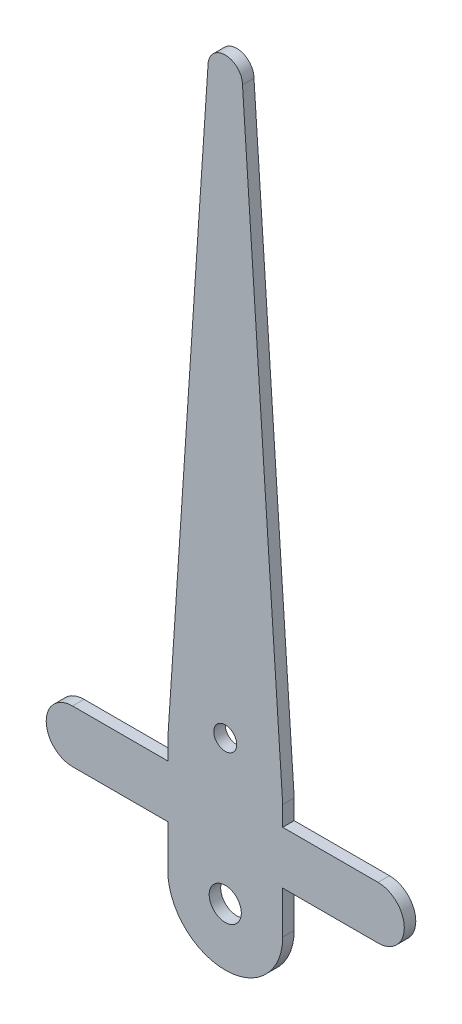
ISO-10303-21;
HEADER;
FILE_DESCRIPTION(('STEP AP214'),'2;1');
FILE_NAME('part.step','',(''),(''),'','','');
FILE_SCHEMA(('AUTOMOTIVE_DESIGN { 1 0 10303 214 1 1 1 1 }'));
ENDSEC;
DATA;
#1=APPLICATION_CONTEXT('core data for automotive mechanical design processes');
#2=APPLICATION_PROTOCOL_DEFINITION('international standard','automotive_design',2000,#1);
#3=PRODUCT_CONTEXT('',#1,'mechanical');
#4=PRODUCT('Part','Part','',(#3));
#5=PRODUCT_RELATED_PRODUCT_CATEGORY('part','',(#4));
#6=PRODUCT_DEFINITION_FORMATION('','',#4);
#7=PRODUCT_DEFINITION_CONTEXT('part definition',#1,'design');
#8=PRODUCT_DEFINITION('design','',#6,#7);
#9=PRODUCT_DEFINITION_SHAPE('','',#8);
#10=(LENGTH_UNIT() NAMED_UNIT(*) SI_UNIT(.MILLI.,.METRE.));
#11=(NAMED_UNIT(*) PLANE_ANGLE_UNIT() SI_UNIT($,.RADIAN.));
#12=(NAMED_UNIT(*) SI_UNIT($,.STERADIAN.) SOLID_ANGLE_UNIT());
#13=UNCERTAINTY_MEASURE_WITH_UNIT(LENGTH_MEASURE(1.E-05),#10,'distance_accuracy_value','');
#14=(GEOMETRIC_REPRESENTATION_CONTEXT(3) GLOBAL_UNCERTAINTY_ASSIGNED_CONTEXT((#13)) GLOBAL_UNIT_ASSIGNED_CONTEXT((#10,
#11,#12)) REPRESENTATION_CONTEXT('',''));
#15=CARTESIAN_POINT('',(0.,0.,0.));
#16=DIRECTION('',(0.,0.,1.));
#17=DIRECTION('',(1.,0.,0.));
#18=AXIS2_PLACEMENT_3D('',#15,#16,#17);
#19=CARTESIAN_POINT('',(40.2064059991123,-5.76156265527696,-1.));
#20=DIRECTION('',(-1.,0.,0.));
#21=DIRECTION('',(0.,-1.,0.));
#22=AXIS2_PLACEMENT_3D('',#19,#20,#21);
#23=PLANE('',#22);
#24=DIRECTION('',(0.,-1.,0.));
#25=VECTOR('',#24,1.);
#26=CARTESIAN_POINT('',(40.2064059991123,-5.76156265527696,0.));
#27=LINE('',#26,#25);
#28=CARTESIAN_POINT('',(40.2064059991123,-5.76156265527696,0.));
#29=VERTEX_POINT('',#28);
#30=CARTESIAN_POINT('',(40.2064059991123,-7.48765316316613,0.));
#31=VERTEX_POINT('',#30);
#32=EDGE_CURVE('E171',#29,#31,#27,.T.);
#33=ORIENTED_EDGE('',*,*,#32,.F.);
#34=DIRECTION('',(0.,0.,1.));
#35=VECTOR('',#34,1.);
#36=CARTESIAN_POINT('',(40.2064059991123,-5.76156265527696,-1.));
#37=LINE('',#36,#35);
#38=CARTESIAN_POINT('',(40.2064059991123,-5.76156265527696,-1.));
#39=VERTEX_POINT('',#38);
#40=EDGE_CURVE('E11',#39,#29,#37,.T.);
#41=ORIENTED_EDGE('',*,*,#40,.F.);
#42=DIRECTION('',(0.,-1.,0.));
#43=VECTOR('',#42,1.);
#44=CARTESIAN_POINT('',(40.2064059991123,-5.76156265527696,-1.));
#45=LINE('',#44,#43);
#46=CARTESIAN_POINT('',(40.2064059991123,-7.48765316316613,-1.));
#47=VERTEX_POINT('',#46);
#48=EDGE_CURVE('E210',#39,#47,#45,.T.);
#49=ORIENTED_EDGE('',*,*,#48,.T.);
#50=DIRECTION('',(0.,0.,1.));
#51=VECTOR('',#50,1.);
#52=CARTESIAN_POINT('',(40.2064059991123,-7.48765316316613,-1.));
#53=LINE('',#52,#51);
#54=EDGE_CURVE('E41',#47,#31,#53,.T.);
#55=ORIENTED_EDGE('',*,*,#54,.T.);
#56=EDGE_LOOP('',(#33,#41,#49,#55));
#57=FACE_BOUND('',#56,.T.);
#58=ADVANCED_FACE('F38',(#57),#23,.T.);
#59=CARTESIAN_POINT('',(40.2064059991123,-5.76156265527696,-1.));
#60=DIRECTION('',(-0.997785420050705,0.0665150774955398,0.));
#61=DIRECTION('',(-0.0665150774955398,-0.997785420050705,0.));
#62=AXIS2_PLACEMENT_3D('',#59,#60,#61);
#63=PLANE('',#62);
#64=DIRECTION('',(-0.0665150774955398,-0.997785420050705,0.));
#65=VECTOR('',#64,1.);
#66=CARTESIAN_POINT('',(40.2064059991123,-5.76156265527696,0.));
#67=LINE('',#66,#65);
#68=CARTESIAN_POINT('',(43.7061982074698,46.7384383999771,0.));
#69=VERTEX_POINT('',#68);
#70=EDGE_CURVE('E208',#69,#29,#67,.T.);
#71=ORIENTED_EDGE('',*,*,#70,.F.);
#72=DIRECTION('',(0.,0.,1.));
#73=VECTOR('',#72,1.);
#74=CARTESIAN_POINT('',(43.7061982074698,46.7384383999771,-1.));
#75=LINE('',#74,#73);
#76=CARTESIAN_POINT('',(43.7061982074698,46.7384383999771,-1.));
#77=VERTEX_POINT('',#76);
#78=EDGE_CURVE('E47',#77,#69,#75,.T.);
#79=ORIENTED_EDGE('',*,*,#78,.F.);
#80=DIRECTION('',(-0.0665150774955398,-0.997785420050705,0.));
#81=VECTOR('',#80,1.);
#82=CARTESIAN_POINT('',(40.2064059991123,-5.76156265527696,-1.));
#83=LINE('',#82,#81);
#84=EDGE_CURVE('E161',#77,#39,#83,.T.);
#85=ORIENTED_EDGE('',*,*,#84,.T.);
#86=ORIENTED_EDGE('',*,*,#40,.T.);
#87=EDGE_LOOP('',(#71,#79,#85,#86));
#88=FACE_BOUND('',#87,.T.);
#89=ADVANCED_FACE('F234',(#88),#63,.T.);
#90=CARTESIAN_POINT('',(45.2061982074698,46.7384383982494,-1.));
#91=DIRECTION('',(0.,0.,1.));
#92=DIRECTION('',(1.,0.,0.));
#93=AXIS2_PLACEMENT_3D('',#90,#91,#92);
#94=CYLINDRICAL_SURFACE('',#93,1.5);
#95=CARTESIAN_POINT('',(45.2061982074698,46.7384383982494,0.));
#96=DIRECTION('',(0.,0.,1.));
#97=DIRECTION('',(1.,0.,0.));
#98=AXIS2_PLACEMENT_3D('',#95,#96,#97);
#99=CIRCLE('',#98,1.5);
#100=CARTESIAN_POINT('',(46.7061982074698,46.7384383999771,0.));
#101=VERTEX_POINT('',#100);
#102=EDGE_CURVE('E148',#101,#69,#99,.T.);
#103=ORIENTED_EDGE('',*,*,#102,.F.);
#104=DIRECTION('',(0.,0.,1.));
#105=VECTOR('',#104,1.);
#106=CARTESIAN_POINT('',(46.7061982074698,46.7384383999771,-1.));
#107=LINE('',#106,#105);
#108=CARTESIAN_POINT('',(46.7061982074698,46.7384383999771,-1.));
#109=VERTEX_POINT('',#108);
#110=EDGE_CURVE('E143',#109,#101,#107,.T.);
#111=ORIENTED_EDGE('',*,*,#110,.F.);
#112=CARTESIAN_POINT('',(45.2061982074698,46.7384383982494,-1.));
#113=DIRECTION('',(0.,0.,1.));
#114=DIRECTION('',(1.,0.,0.));
#115=AXIS2_PLACEMENT_3D('',#112,#113,#114);
#116=CIRCLE('',#115,1.5);
#117=EDGE_CURVE('E146',#109,#77,#116,.T.);
#118=ORIENTED_EDGE('',*,*,#117,.T.);
#119=ORIENTED_EDGE('',*,*,#78,.T.);
#120=EDGE_LOOP('',(#103,#111,#118,#119));
#121=FACE_BOUND('',#120,.T.);
#122=ADVANCED_FACE('F145',(#121),#94,.T.);
#123=CARTESIAN_POINT('',(50.2059904158273,-5.76156265527696,-1.));
#124=DIRECTION('',(0.997785420050705,0.0665150774955406,0.));
#125=DIRECTION('',(-0.0665150774955406,0.997785420050705,0.));
#126=AXIS2_PLACEMENT_3D('',#123,#124,#125);
#127=PLANE('',#126);
#128=DIRECTION('',(-0.0665150774955406,0.997785420050705,0.));
#129=VECTOR('',#128,1.);
#130=CARTESIAN_POINT('',(50.2059904158273,-5.76156265527696,0.));
#131=LINE('',#130,#129);
#132=CARTESIAN_POINT('',(50.2059904158273,-5.76156265527696,0.));
#133=VERTEX_POINT('',#132);
#134=EDGE_CURVE('E205',#133,#101,#131,.T.);
#135=ORIENTED_EDGE('',*,*,#134,.F.);
#136=DIRECTION('',(0.,0.,1.));
#137=VECTOR('',#136,1.);
#138=CARTESIAN_POINT('',(50.2059904158273,-5.76156265527696,-1.));
#139=LINE('',#138,#137);
#140=CARTESIAN_POINT('',(50.2059904158273,-5.76156265527696,-1.));
#141=VERTEX_POINT('',#140);
#142=EDGE_CURVE('E153',#141,#133,#139,.T.);
#143=ORIENTED_EDGE('',*,*,#142,.F.);
#144=DIRECTION('',(-0.0665150774955406,0.997785420050705,0.));
#145=VECTOR('',#144,1.);
#146=CARTESIAN_POINT('',(50.2059904158273,-5.76156265527696,-1.));
#147=LINE('',#146,#145);
#148=EDGE_CURVE('E159',#141,#109,#147,.T.);
#149=ORIENTED_EDGE('',*,*,#148,.T.);
#150=ORIENTED_EDGE('',*,*,#110,.T.);
#151=EDGE_LOOP('',(#135,#143,#149,#150));
#152=FACE_BOUND('',#151,.T.);
#153=ADVANCED_FACE('F163',(#152),#127,.T.);
#154=CARTESIAN_POINT('',(50.2059904158273,-5.76156265527696,-1.));
#155=DIRECTION('',(1.,0.,0.));
#156=DIRECTION('',(0.,1.,0.));
#157=AXIS2_PLACEMENT_3D('',#154,#155,#156);
#158=PLANE('',#157);
#159=DIRECTION('',(0.,1.,0.));
#160=VECTOR('',#159,1.);
#161=CARTESIAN_POINT('',(50.2059904158273,-5.76156265527696,0.));
#162=LINE('',#161,#160);
#163=CARTESIAN_POINT('',(50.2059904158272,-7.48765316316613,0.));
#164=VERTEX_POINT('',#163);
#165=EDGE_CURVE('E202',#164,#133,#162,.T.);
#166=ORIENTED_EDGE('',*,*,#165,.F.);
#167=DIRECTION('',(0.,0.,1.));
#168=VECTOR('',#167,1.);
#169=CARTESIAN_POINT('',(50.2059904158272,-7.48765316316613,-1.));
#170=LINE('',#169,#168);
#171=CARTESIAN_POINT('',(50.2059904158272,-7.48765316316613,-1.));
#172=VERTEX_POINT('',#171);
#173=EDGE_CURVE('E214',#172,#164,#170,.T.);
#174=ORIENTED_EDGE('',*,*,#173,.F.);
#175=DIRECTION('',(0.,1.,0.));
#176=VECTOR('',#175,1.);
#177=CARTESIAN_POINT('',(50.2059904158273,-5.76156265527696,-1.));
#178=LINE('',#177,#176);
#179=EDGE_CURVE('E164',#172,#141,#178,.T.);
#180=ORIENTED_EDGE('',*,*,#179,.T.);
#181=ORIENTED_EDGE('',*,*,#142,.T.);
#182=EDGE_LOOP('',(#166,#174,#180,#181));
#183=FACE_BOUND('',#182,.T.);
#184=ADVANCED_FACE('F247',(#183),#158,.T.);
#185=CARTESIAN_POINT('',(50.2059904158272,-7.48765316316613,-1.));
#186=DIRECTION('',(0.,1.,0.));
#187=DIRECTION('',(-1.,0.,0.));
#188=AXIS2_PLACEMENT_3D('',#185,#186,#187);
#189=PLANE('',#188);
#190=DIRECTION('',(-1.,0.,0.));
#191=VECTOR('',#190,1.);
#192=CARTESIAN_POINT('',(50.2059904158272,-7.48765316316613,0.));
#193=LINE('',#192,#191);
#194=CARTESIAN_POINT('',(58.5021856547374,-7.48765316316613,0.));
#195=VERTEX_POINT('',#194);
#196=EDGE_CURVE('E199',#195,#164,#193,.T.);
#197=ORIENTED_EDGE('',*,*,#196,.F.);
#198=DIRECTION('',(0.,0.,1.));
#199=VECTOR('',#198,1.);
#200=CARTESIAN_POINT('',(58.5021856547374,-7.48765316316613,-1.));
#201=LINE('',#200,#199);
#202=CARTESIAN_POINT('',(58.5021856547374,-7.48765316316613,-1.));
#203=VERTEX_POINT('',#202);
#204=EDGE_CURVE('E216',#203,#195,#201,.T.);
#205=ORIENTED_EDGE('',*,*,#204,.F.);
#206=DIRECTION('',(-1.,0.,0.));
#207=VECTOR('',#206,1.);
#208=CARTESIAN_POINT('',(50.2059904158272,-7.48765316316613,-1.));
#209=LINE('',#208,#207);
#210=EDGE_CURVE('E166',#203,#172,#209,.T.);
#211=ORIENTED_EDGE('',*,*,#210,.T.);
#212=ORIENTED_EDGE('',*,*,#173,.T.);
#213=EDGE_LOOP('',(#197,#205,#211,#212));
#214=FACE_BOUND('',#213,.T.);
#215=ADVANCED_FACE('F250',(#214),#189,.T.);
#216=CARTESIAN_POINT('',(58.5021856547375,-9.77793096782937,-1.));
#217=DIRECTION('',(0.,0.,1.));
#218=DIRECTION('',(1.,0.,0.));
#219=AXIS2_PLACEMENT_3D('',#216,#217,#218);
#220=CYLINDRICAL_SURFACE('',#219,2.29027780466324);
#221=CARTESIAN_POINT('',(58.5021856547375,-9.77793096782937,0.));
#222=DIRECTION('',(0.,0.,1.));
#223=DIRECTION('',(-1.,0.,0.));
#224=AXIS2_PLACEMENT_3D('',#221,#222,#223);
#225=CIRCLE('',#224,2.29027780466324);
#226=CARTESIAN_POINT('',(58.5021856547375,-12.0682087724926,0.));
#227=VERTEX_POINT('',#226);
#228=EDGE_CURVE('E196',#227,#195,#225,.T.);
#229=ORIENTED_EDGE('',*,*,#228,.F.);
#230=DIRECTION('',(0.,0.,1.));
#231=VECTOR('',#230,1.);
#232=CARTESIAN_POINT('',(58.5021856547375,-12.0682087724926,-1.));
#233=LINE('',#232,#231);
#234=CARTESIAN_POINT('',(58.5021856547375,-12.0682087724926,-1.));
#235=VERTEX_POINT('',#234);
#236=EDGE_CURVE('E218',#235,#227,#233,.T.);
#237=ORIENTED_EDGE('',*,*,#236,.F.);
#238=CARTESIAN_POINT('',(58.5021856547375,-9.77793096782937,-1.));
#239=DIRECTION('',(0.,0.,1.));
#240=DIRECTION('',(-1.,0.,0.));
#241=AXIS2_PLACEMENT_3D('',#238,#239,#240);
#242=CIRCLE('',#241,2.29027780466324);
#243=EDGE_CURVE('E338',#235,#203,#242,.T.);
#244=ORIENTED_EDGE('',*,*,#243,.T.);
#245=ORIENTED_EDGE('',*,*,#204,.T.);
#246=EDGE_LOOP('',(#229,#237,#244,#245));
#247=FACE_BOUND('',#246,.T.);
#248=ADVANCED_FACE('F254',(#247),#220,.T.);
#249=CARTESIAN_POINT('',(58.5021856547375,-12.0682087724926,-1.));
#250=DIRECTION('',(0.,-1.,0.));
#251=DIRECTION('',(0.,0.,-1.));
#252=AXIS2_PLACEMENT_3D('',#249,#250,#251);
#253=PLANE('',#252);
#254=DIRECTION('',(1.,0.,0.));
#255=VECTOR('',#254,1.);
#256=CARTESIAN_POINT('',(58.5021856547375,-12.0682087724926,0.));
#257=LINE('',#256,#255);
#258=CARTESIAN_POINT('',(50.2061982153836,-12.0682087724926,0.));
#259=VERTEX_POINT('',#258);
#260=EDGE_CURVE('E193',#259,#227,#257,.T.);
#261=ORIENTED_EDGE('',*,*,#260,.F.);
#262=DIRECTION('',(0.,0.,1.));
#263=VECTOR('',#262,1.);
#264=CARTESIAN_POINT('',(50.2061982153836,-12.0682087724926,-1.));
#265=LINE('',#264,#263);
#266=CARTESIAN_POINT('',(50.2061982153836,-12.0682087724926,-1.));
#267=VERTEX_POINT('',#266);
#268=EDGE_CURVE('E220',#267,#259,#265,.T.);
#269=ORIENTED_EDGE('',*,*,#268,.F.);
#270=DIRECTION('',(1.,0.,0.));
#271=VECTOR('',#270,1.);
#272=CARTESIAN_POINT('',(58.5021856547375,-12.0682087724926,-1.));
#273=LINE('',#272,#271);
#274=EDGE_CURVE('E335',#267,#235,#273,.T.);
#275=ORIENTED_EDGE('',*,*,#274,.T.);
#276=ORIENTED_EDGE('',*,*,#236,.T.);
#277=EDGE_LOOP('',(#261,#269,#275,#276));
#278=FACE_BOUND('',#277,.T.);
#279=ADVANCED_FACE('F258',(#278),#253,.T.);
#280=CARTESIAN_POINT('',(50.2061982153836,-12.0682087724926,-1.));
#281=DIRECTION('',(0.999999998417232,-5.62631048063439E-05,0.));
#282=DIRECTION('',(5.62631048063439E-05,0.999999998417232,0.));
#283=AXIS2_PLACEMENT_3D('',#280,#281,#282);
#284=PLANE('',#283);
#285=DIRECTION('',(5.62631048063439E-05,0.999999998417232,0.));
#286=VECTOR('',#285,1.);
#287=CARTESIAN_POINT('',(50.2061982153836,-12.0682087724926,0.));
#288=LINE('',#287,#286);
#289=CARTESIAN_POINT('',(50.2059904158272,-15.7615626466408,0.));
#290=VERTEX_POINT('',#289);
#291=EDGE_CURVE('E190',#290,#259,#288,.T.);
#292=ORIENTED_EDGE('',*,*,#291,.F.);
#293=DIRECTION('',(0.,0.,1.));
#294=VECTOR('',#293,1.);
#295=CARTESIAN_POINT('',(50.2059904158272,-15.7615626466408,-1.));
#296=LINE('',#295,#294);
#297=CARTESIAN_POINT('',(50.2059904158272,-15.7615626466408,-1.));
#298=VERTEX_POINT('',#297);
#299=EDGE_CURVE('E222',#298,#290,#296,.T.);
#300=ORIENTED_EDGE('',*,*,#299,.F.);
#301=DIRECTION('',(5.62631048063439E-05,0.999999998417232,0.));
#302=VECTOR('',#301,1.);
#303=CARTESIAN_POINT('',(50.2061982153836,-12.0682087724926,-1.));
#304=LINE('',#303,#302);
#305=EDGE_CURVE('E332',#298,#267,#304,.T.);
#306=ORIENTED_EDGE('',*,*,#305,.T.);
#307=ORIENTED_EDGE('',*,*,#268,.T.);
#308=EDGE_LOOP('',(#292,#300,#306,#307));
#309=FACE_BOUND('',#308,.T.);
#310=ADVANCED_FACE('F262',(#309),#284,.T.);
#311=CARTESIAN_POINT('',(45.2059904079134,-15.7615616000238,-1.));
#312=DIRECTION('',(0.,0.,1.));
#313=DIRECTION('',(1.,0.,0.));
#314=AXIS2_PLACEMENT_3D('',#311,#312,#313);
#315=CYLINDRICAL_SURFACE('',#314,5.00000000791396);
#316=CARTESIAN_POINT('',(45.2059904079134,-15.7615616000238,0.));
#317=DIRECTION('',(0.,0.,1.));
#318=DIRECTION('',(1.,0.,0.));
#319=AXIS2_PLACEMENT_3D('',#316,#317,#318);
#320=CIRCLE('',#319,5.00000000791396);
#321=CARTESIAN_POINT('',(40.2059903999995,-15.7615626466408,0.));
#322=VERTEX_POINT('',#321);
#323=EDGE_CURVE('E187',#322,#290,#320,.T.);
#324=ORIENTED_EDGE('',*,*,#323,.F.);
#325=DIRECTION('',(0.,0.,1.));
#326=VECTOR('',#325,1.);
#327=CARTESIAN_POINT('',(40.2059903999995,-15.7615626466408,-1.));
#328=LINE('',#327,#326);
#329=CARTESIAN_POINT('',(40.2059903999995,-15.7615626466408,-1.));
#330=VERTEX_POINT('',#329);
#331=EDGE_CURVE('E224',#330,#322,#328,.T.);
#332=ORIENTED_EDGE('',*,*,#331,.F.);
#333=CARTESIAN_POINT('',(45.2059904079134,-15.7615616000238,-1.));
#334=DIRECTION('',(0.,0.,1.));
#335=DIRECTION('',(1.,0.,0.));
#336=AXIS2_PLACEMENT_3D('',#333,#334,#335);
#337=CIRCLE('',#336,5.00000000791396);
#338=EDGE_CURVE('E329',#330,#298,#337,.T.);
#339=ORIENTED_EDGE('',*,*,#338,.T.);
#340=ORIENTED_EDGE('',*,*,#299,.T.);
#341=EDGE_LOOP('',(#324,#332,#339,#340));
#342=FACE_BOUND('',#341,.T.);
#343=ADVANCED_FACE('F266',(#342),#315,.T.);
#344=CARTESIAN_POINT('',(40.206198199556,-12.0682087724926,-1.));
#345=DIRECTION('',(-0.999999998417232,5.62631048082227E-05,0.));
#346=DIRECTION('',(-5.62631048082227E-05,-0.999999998417232,0.));
#347=AXIS2_PLACEMENT_3D('',#344,#345,#346);
#348=PLANE('',#347);
#349=DIRECTION('',(-5.62631048082227E-05,-0.999999998417232,0.));
#350=VECTOR('',#349,1.);
#351=CARTESIAN_POINT('',(40.206198199556,-12.0682087724926,0.));
#352=LINE('',#351,#350);
#353=CARTESIAN_POINT('',(40.206198199556,-12.0682087724926,0.));
#354=VERTEX_POINT('',#353);
#355=EDGE_CURVE('E184',#354,#322,#352,.T.);
#356=ORIENTED_EDGE('',*,*,#355,.F.);
#357=DIRECTION('',(0.,0.,1.));
#358=VECTOR('',#357,1.);
#359=CARTESIAN_POINT('',(40.206198199556,-12.0682087724926,-1.));
#360=LINE('',#359,#358);
#361=CARTESIAN_POINT('',(40.206198199556,-12.0682087724926,-1.));
#362=VERTEX_POINT('',#361);
#363=EDGE_CURVE('E226',#362,#354,#360,.T.);
#364=ORIENTED_EDGE('',*,*,#363,.F.);
#365=DIRECTION('',(-5.62631048082227E-05,-0.999999998417232,0.));
#366=VECTOR('',#365,1.);
#367=CARTESIAN_POINT('',(40.206198199556,-12.0682087724926,-1.));
#368=LINE('',#367,#366);
#369=EDGE_CURVE('E326',#362,#330,#368,.T.);
#370=ORIENTED_EDGE('',*,*,#369,.T.);
#371=ORIENTED_EDGE('',*,*,#331,.T.);
#372=EDGE_LOOP('',(#356,#364,#370,#371));
#373=FACE_BOUND('',#372,.T.);
#374=ADVANCED_FACE('F270',(#373),#348,.T.);
#375=CARTESIAN_POINT('',(31.9102107602021,-12.0682087724926,-1.));
#376=DIRECTION('',(0.,-1.,0.));
#377=DIRECTION('',(0.,0.,-1.));
#378=AXIS2_PLACEMENT_3D('',#375,#376,#377);
#379=PLANE('',#378);
#380=DIRECTION('',(1.,0.,0.));
#381=VECTOR('',#380,1.);
#382=CARTESIAN_POINT('',(31.9102107602021,-12.0682087724926,0.));
#383=LINE('',#382,#381);
#384=CARTESIAN_POINT('',(31.9102107602021,-12.0682087724926,0.));
#385=VERTEX_POINT('',#384);
#386=EDGE_CURVE('E181',#385,#354,#383,.T.);
#387=ORIENTED_EDGE('',*,*,#386,.F.);
#388=DIRECTION('',(0.,0.,1.));
#389=VECTOR('',#388,1.);
#390=CARTESIAN_POINT('',(31.9102107602021,-12.0682087724926,-1.));
#391=LINE('',#390,#389);
#392=CARTESIAN_POINT('',(31.9102107602021,-12.0682087724926,-1.));
#393=VERTEX_POINT('',#392);
#394=EDGE_CURVE('E228',#393,#385,#391,.T.);
#395=ORIENTED_EDGE('',*,*,#394,.F.);
#396=DIRECTION('',(1.,0.,0.));
#397=VECTOR('',#396,1.);
#398=CARTESIAN_POINT('',(31.9102107602021,-12.0682087724926,-1.));
#399=LINE('',#398,#397);
#400=EDGE_CURVE('E323',#393,#362,#399,.T.);
#401=ORIENTED_EDGE('',*,*,#400,.T.);
#402=ORIENTED_EDGE('',*,*,#363,.T.);
#403=EDGE_LOOP('',(#387,#395,#401,#402));
#404=FACE_BOUND('',#403,.T.);
#405=ADVANCED_FACE('F274',(#404),#379,.T.);
#406=CARTESIAN_POINT('',(31.9102107602021,-9.77793096782937,-1.));
#407=DIRECTION('',(0.,0.,1.));
#408=DIRECTION('',(1.,0.,0.));
#409=AXIS2_PLACEMENT_3D('',#406,#407,#408);
#410=CYLINDRICAL_SURFACE('',#409,2.29027780466324);
#411=CARTESIAN_POINT('',(31.9102107602021,-9.77793096782937,0.));
#412=DIRECTION('',(0.,0.,1.));
#413=DIRECTION('',(1.,0.,0.));
#414=AXIS2_PLACEMENT_3D('',#411,#412,#413);
#415=CIRCLE('',#414,2.29027780466324);
#416=CARTESIAN_POINT('',(31.9102107602021,-7.48765316316613,0.));
#417=VERTEX_POINT('',#416);
#418=EDGE_CURVE('E178',#417,#385,#415,.T.);
#419=ORIENTED_EDGE('',*,*,#418,.F.);
#420=DIRECTION('',(0.,0.,1.));
#421=VECTOR('',#420,1.);
#422=CARTESIAN_POINT('',(31.9102107602021,-7.48765316316613,-1.));
#423=LINE('',#422,#421);
#424=CARTESIAN_POINT('',(31.9102107602021,-7.48765316316613,-1.));
#425=VERTEX_POINT('',#424);
#426=EDGE_CURVE('E229',#425,#417,#423,.T.);
#427=ORIENTED_EDGE('',*,*,#426,.F.);
#428=CARTESIAN_POINT('',(31.9102107602021,-9.77793096782937,-1.));
#429=DIRECTION('',(0.,0.,1.));
#430=DIRECTION('',(1.,0.,0.));
#431=AXIS2_PLACEMENT_3D('',#428,#429,#430);
#432=CIRCLE('',#431,2.29027780466324);
#433=EDGE_CURVE('E320',#425,#393,#432,.T.);
#434=ORIENTED_EDGE('',*,*,#433,.T.);
#435=ORIENTED_EDGE('',*,*,#394,.T.);
#436=EDGE_LOOP('',(#419,#427,#434,#435));
#437=FACE_BOUND('',#436,.T.);
#438=ADVANCED_FACE('F278',(#437),#410,.T.);
#439=CARTESIAN_POINT('',(40.2064059991123,-7.48765316316613,-1.));
#440=DIRECTION('',(0.,1.,0.));
#441=DIRECTION('',(-1.,0.,0.));
#442=AXIS2_PLACEMENT_3D('',#439,#440,#441);
#443=PLANE('',#442);
#444=DIRECTION('',(-1.,0.,0.));
#445=VECTOR('',#444,1.);
#446=CARTESIAN_POINT('',(40.2064059991123,-7.48765316316613,0.));
#447=LINE('',#446,#445);
#448=EDGE_CURVE('E174',#31,#417,#447,.T.);
#449=ORIENTED_EDGE('',*,*,#448,.F.);
#450=ORIENTED_EDGE('',*,*,#54,.F.);
#451=DIRECTION('',(-1.,0.,0.));
#452=VECTOR('',#451,1.);
#453=CARTESIAN_POINT('',(40.2064059991123,-7.48765316316613,-1.));
#454=LINE('',#453,#452);
#455=EDGE_CURVE('E318',#47,#425,#454,.T.);
#456=ORIENTED_EDGE('',*,*,#455,.T.);
#457=ORIENTED_EDGE('',*,*,#426,.T.);
#458=EDGE_LOOP('',(#449,#450,#456,#457));
#459=FACE_BOUND('',#458,.T.);
#460=ADVANCED_FACE('F231',(#459),#443,.T.);
#461=CARTESIAN_POINT('',(31.9102107602021,-9.77793096782937,-1.));
#462=DIRECTION('',(0.,0.,1.));
#463=DIRECTION('',(1.,0.,0.));
#464=AXIS2_PLACEMENT_3D('',#461,#462,#463);
#465=PLANE('',#464);
#466=CARTESIAN_POINT('',(45.2059904079134,-3.26156160002383,-1.));
#467=DIRECTION('',(0.,0.,1.));
#468=DIRECTION('',(1.,0.,0.));
#469=AXIS2_PLACEMENT_3D('',#466,#467,#468);
#470=CIRCLE('',#469,0.9999999999584);
#471=CARTESIAN_POINT('',(46.2059904078718,-3.26156160002383,-1.));
#472=VERTEX_POINT('',#471);
#473=EDGE_CURVE('E305',#472,#472,#470,.T.);
#474=ORIENTED_EDGE('',*,*,#473,.T.);
#475=EDGE_LOOP('',(#474));
#476=FACE_BOUND('',#475,.T.);
#477=CARTESIAN_POINT('',(45.2059904079134,-15.7615616000238,-1.));
#478=DIRECTION('',(0.,0.,1.));
#479=DIRECTION('',(1.,0.,0.));
#480=AXIS2_PLACEMENT_3D('',#477,#478,#479);
#481=CIRCLE('',#480,1.3999999999584);
#482=CARTESIAN_POINT('',(46.6059904078718,-15.7615616000238,-1.));
#483=VERTEX_POINT('',#482);
#484=EDGE_CURVE('E175',#483,#483,#481,.T.);
#485=ORIENTED_EDGE('',*,*,#484,.T.);
#486=EDGE_LOOP('',(#485));
#487=FACE_BOUND('',#486,.T.);
#488=ORIENTED_EDGE('',*,*,#48,.F.);
#489=ORIENTED_EDGE('',*,*,#84,.F.);
#490=ORIENTED_EDGE('',*,*,#117,.F.);
#491=ORIENTED_EDGE('',*,*,#148,.F.);
#492=ORIENTED_EDGE('',*,*,#179,.F.);
#493=ORIENTED_EDGE('',*,*,#210,.F.);
#494=ORIENTED_EDGE('',*,*,#243,.F.);
#495=ORIENTED_EDGE('',*,*,#274,.F.);
#496=ORIENTED_EDGE('',*,*,#305,.F.);
#497=ORIENTED_EDGE('',*,*,#338,.F.);
#498=ORIENTED_EDGE('',*,*,#369,.F.);
#499=ORIENTED_EDGE('',*,*,#400,.F.);
#500=ORIENTED_EDGE('',*,*,#433,.F.);
#501=ORIENTED_EDGE('',*,*,#455,.F.);
#502=EDGE_LOOP('',(#488,#489,#490,#491,#492,#493,#494,#495,#496,#497,#498,#499,#500,#501));
#503=FACE_BOUND('',#502,.T.);
#504=ADVANCED_FACE('F157',(#476,#487,#503),#465,.F.);
#505=CARTESIAN_POINT('',(31.9102107602021,-9.77793096782937,0.));
#506=DIRECTION('',(0.,0.,1.));
#507=DIRECTION('',(1.,0.,0.));
#508=AXIS2_PLACEMENT_3D('',#505,#506,#507);
#509=PLANE('',#508);
#510=CARTESIAN_POINT('',(45.2059904079134,-3.26156160002383,0.));
#511=DIRECTION('',(0.,0.,1.));
#512=DIRECTION('',(1.,0.,0.));
#513=AXIS2_PLACEMENT_3D('',#510,#511,#512);
#514=CIRCLE('',#513,0.9999999999584);
#515=CARTESIAN_POINT('',(46.2059904078718,-3.26156160002383,0.));
#516=VERTEX_POINT('',#515);
#517=EDGE_CURVE('E308',#516,#516,#514,.T.);
#518=ORIENTED_EDGE('',*,*,#517,.F.);
#519=EDGE_LOOP('',(#518));
#520=FACE_BOUND('',#519,.T.);
#521=CARTESIAN_POINT('',(45.2059904079134,-15.7615616000238,0.));
#522=DIRECTION('',(0.,0.,1.));
#523=DIRECTION('',(1.,0.,0.));
#524=AXIS2_PLACEMENT_3D('',#521,#522,#523);
#525=CIRCLE('',#524,1.3999999999584);
#526=CARTESIAN_POINT('',(46.6059904078718,-15.7615616000238,0.));
#527=VERTEX_POINT('',#526);
#528=EDGE_CURVE('E310',#527,#527,#525,.T.);
#529=ORIENTED_EDGE('',*,*,#528,.F.);
#530=EDGE_LOOP('',(#529));
#531=FACE_BOUND('',#530,.T.);
#532=ORIENTED_EDGE('',*,*,#32,.T.);
#533=ORIENTED_EDGE('',*,*,#448,.T.);
#534=ORIENTED_EDGE('',*,*,#418,.T.);
#535=ORIENTED_EDGE('',*,*,#386,.T.);
#536=ORIENTED_EDGE('',*,*,#355,.T.);
#537=ORIENTED_EDGE('',*,*,#323,.T.);
#538=ORIENTED_EDGE('',*,*,#291,.T.);
#539=ORIENTED_EDGE('',*,*,#260,.T.);
#540=ORIENTED_EDGE('',*,*,#228,.T.);
#541=ORIENTED_EDGE('',*,*,#196,.T.);
#542=ORIENTED_EDGE('',*,*,#165,.T.);
#543=ORIENTED_EDGE('',*,*,#134,.T.);
#544=ORIENTED_EDGE('',*,*,#102,.T.);
#545=ORIENTED_EDGE('',*,*,#70,.T.);
#546=EDGE_LOOP('',(#532,#533,#534,#535,#536,#537,#538,#539,#540,#541,#542,#543,#544,#545));
#547=FACE_BOUND('',#546,.T.);
#548=ADVANCED_FACE('F233',(#520,#531,#547),#509,.T.);
#549=CARTESIAN_POINT('',(45.2059904079134,-15.7615616000238,-1.));
#550=DIRECTION('',(0.,0.,1.));
#551=DIRECTION('',(1.,0.,0.));
#552=AXIS2_PLACEMENT_3D('',#549,#550,#551);
#553=CYLINDRICAL_SURFACE('',#552,1.3999999999584);
#554=ORIENTED_EDGE('',*,*,#484,.F.);
#555=EDGE_LOOP('',(#554));
#556=FACE_BOUND('',#555,.T.);
#557=ORIENTED_EDGE('',*,*,#528,.T.);
#558=EDGE_LOOP('',(#557));
#559=FACE_BOUND('',#558,.T.);
#560=ADVANCED_FACE('F290',(#556,#559),#553,.F.);
#561=CARTESIAN_POINT('',(45.2059904079134,-3.26156160002383,-1.));
#562=DIRECTION('',(0.,0.,1.));
#563=DIRECTION('',(1.,0.,0.));
#564=AXIS2_PLACEMENT_3D('',#561,#562,#563);
#565=CYLINDRICAL_SURFACE('',#564,0.9999999999584);
#566=ORIENTED_EDGE('',*,*,#473,.F.);
#567=EDGE_LOOP('',(#566));
#568=FACE_BOUND('',#567,.T.);
#569=ORIENTED_EDGE('',*,*,#517,.T.);
#570=EDGE_LOOP('',(#569));
#571=FACE_BOUND('',#570,.T.);
#572=ADVANCED_FACE('F297',(#568,#571),#565,.F.);
#573=CLOSED_SHELL('',(#58,#89,#122,#153,#184,#215,#248,#279,#310,#343,#374,#405,#438,#460,#504,
#548,#560,#572));
#574=MANIFOLD_SOLID_BREP('B2',#573);
#575=ADVANCED_BREP_SHAPE_REPRESENTATION('',(#18,#574),#14);
#576=SHAPE_DEFINITION_REPRESENTATION(#9,#575);
ENDSEC;
END-ISO-10303-21;
